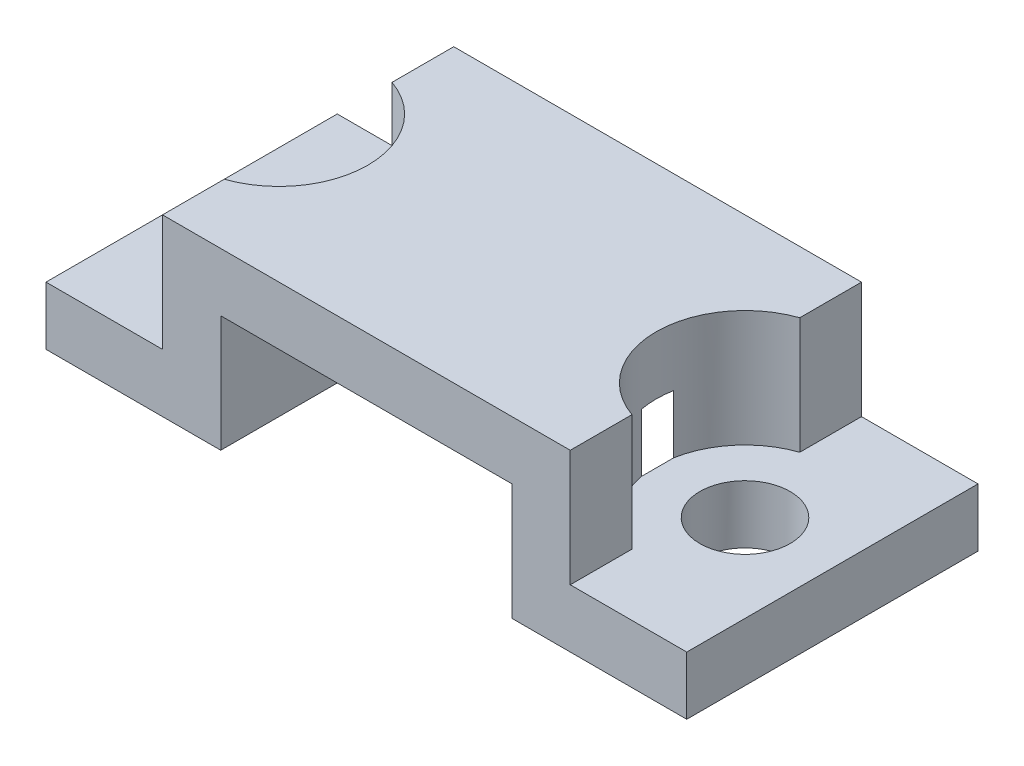
ISO-10303-21;
HEADER;
FILE_DESCRIPTION(('STEP AP214'),'2;1');
FILE_NAME('part.step','',(''),(''),'','','');
FILE_SCHEMA(('AUTOMOTIVE_DESIGN { 1 0 10303 214 1 1 1 1 }'));
ENDSEC;
DATA;
#1=APPLICATION_CONTEXT('core data for automotive mechanical design processes');
#2=APPLICATION_PROTOCOL_DEFINITION('international standard','automotive_design',2000,#1);
#3=PRODUCT_CONTEXT('',#1,'mechanical');
#4=PRODUCT('Part','Part','',(#3));
#5=PRODUCT_RELATED_PRODUCT_CATEGORY('part','',(#4));
#6=PRODUCT_DEFINITION_FORMATION('','',#4);
#7=PRODUCT_DEFINITION_CONTEXT('part definition',#1,'design');
#8=PRODUCT_DEFINITION('design','',#6,#7);
#9=PRODUCT_DEFINITION_SHAPE('','',#8);
#10=(LENGTH_UNIT() NAMED_UNIT(*) SI_UNIT(.MILLI.,.METRE.));
#11=(NAMED_UNIT(*) PLANE_ANGLE_UNIT() SI_UNIT($,.RADIAN.));
#12=(NAMED_UNIT(*) SI_UNIT($,.STERADIAN.) SOLID_ANGLE_UNIT());
#13=UNCERTAINTY_MEASURE_WITH_UNIT(LENGTH_MEASURE(1.E-05),#10,'distance_accuracy_value','');
#14=(GEOMETRIC_REPRESENTATION_CONTEXT(3) GLOBAL_UNCERTAINTY_ASSIGNED_CONTEXT((#13)) GLOBAL_UNIT_ASSIGNED_CONTEXT((#10,
#11,#12)) REPRESENTATION_CONTEXT('',''));
#15=CARTESIAN_POINT('',(0.,0.,0.));
#16=DIRECTION('',(0.,0.,1.));
#17=DIRECTION('',(1.,0.,0.));
#18=AXIS2_PLACEMENT_3D('',#15,#16,#17);
#19=CARTESIAN_POINT('',(-5.,0.,-19.));
#20=DIRECTION('',(1.,0.,0.));
#21=DIRECTION('',(0.,0.,-1.));
#22=AXIS2_PLACEMENT_3D('',#19,#20,#21);
#23=PLANE('',#22);
#24=DIRECTION('',(0.,0.,1.));
#25=VECTOR('',#24,1.);
#26=CARTESIAN_POINT('',(-5.,2.,-19.));
#27=LINE('',#26,#25);
#28=CARTESIAN_POINT('',(-5.,2.,-0.550000000000018));
#29=VERTEX_POINT('',#28);
#30=CARTESIAN_POINT('',(-5.,2.,0.550000000000018));
#31=VERTEX_POINT('',#30);
#32=EDGE_CURVE('E394',#29,#31,#27,.T.);
#33=ORIENTED_EDGE('',*,*,#32,.T.);
#34=DIRECTION('',(0.,-1.,0.));
#35=VECTOR('',#34,1.);
#36=CARTESIAN_POINT('',(-5.,7.99999999999999,0.550000000000018));
#37=LINE('',#36,#35);
#38=CARTESIAN_POINT('',(-5.,4.,0.550000000000018));
#39=VERTEX_POINT('',#38);
#40=EDGE_CURVE('E379',#31,#39,#37,.F.);
#41=ORIENTED_EDGE('',*,*,#40,.T.);
#42=DIRECTION('',(0.,0.,1.));
#43=VECTOR('',#42,1.);
#44=CARTESIAN_POINT('',(-5.,4.,-19.));
#45=LINE('',#44,#43);
#46=CARTESIAN_POINT('',(-5.,4.,5.));
#47=VERTEX_POINT('',#46);
#48=EDGE_CURVE('E227',#39,#47,#45,.T.);
#49=ORIENTED_EDGE('',*,*,#48,.T.);
#50=DIRECTION('',(0.,1.,0.));
#51=VECTOR('',#50,1.);
#52=CARTESIAN_POINT('',(-5.,0.,5.));
#53=LINE('',#52,#51);
#54=CARTESIAN_POINT('',(-5.,0.,5.));
#55=VERTEX_POINT('',#54);
#56=EDGE_CURVE('E217',#55,#47,#53,.T.);
#57=ORIENTED_EDGE('',*,*,#56,.F.);
#58=DIRECTION('',(0.,0.,1.));
#59=VECTOR('',#58,1.);
#60=CARTESIAN_POINT('',(-5.,0.,0.));
#61=LINE('',#60,#59);
#62=CARTESIAN_POINT('',(-5.,0.,-5.));
#63=VERTEX_POINT('',#62);
#64=EDGE_CURVE('E296',#63,#55,#61,.T.);
#65=ORIENTED_EDGE('',*,*,#64,.F.);
#66=DIRECTION('',(0.,1.,0.));
#67=VECTOR('',#66,1.);
#68=CARTESIAN_POINT('',(-5.,6.,-5.));
#69=LINE('',#68,#67);
#70=CARTESIAN_POINT('',(-5.,4.,-5.));
#71=VERTEX_POINT('',#70);
#72=EDGE_CURVE('E236',#63,#71,#69,.T.);
#73=ORIENTED_EDGE('',*,*,#72,.T.);
#74=CARTESIAN_POINT('',(-5.,4.,-0.550000000000018));
#75=VERTEX_POINT('',#74);
#76=EDGE_CURVE('E222',#71,#75,#45,.T.);
#77=ORIENTED_EDGE('',*,*,#76,.T.);
#78=DIRECTION('',(0.,-1.,0.));
#79=VECTOR('',#78,1.);
#80=CARTESIAN_POINT('',(-5.,7.99999999999999,-0.550000000000018));
#81=LINE('',#80,#79);
#82=EDGE_CURVE('E387',#75,#29,#81,.T.);
#83=ORIENTED_EDGE('',*,*,#82,.T.);
#84=EDGE_LOOP('',(#33,#41,#49,#57,#65,#73,#77,#83));
#85=FACE_BOUND('',#84,.T.);
#86=ADVANCED_FACE('F39',(#85),#23,.T.);
#87=CARTESIAN_POINT('',(5.,0.,-19.));
#88=DIRECTION('',(1.,0.,0.));
#89=DIRECTION('',(0.,0.,-1.));
#90=AXIS2_PLACEMENT_3D('',#87,#88,#89);
#91=PLANE('',#90);
#92=DIRECTION('',(0.,-1.,0.));
#93=VECTOR('',#92,1.);
#94=CARTESIAN_POINT('',(5.,7.99999999999999,0.550000000000008));
#95=LINE('',#94,#93);
#96=CARTESIAN_POINT('',(5.,2.,0.550000000000008));
#97=VERTEX_POINT('',#96);
#98=CARTESIAN_POINT('',(5.,4.,0.550000000000008));
#99=VERTEX_POINT('',#98);
#100=EDGE_CURVE('E365',#97,#99,#95,.F.);
#101=ORIENTED_EDGE('',*,*,#100,.F.);
#102=DIRECTION('',(0.,0.,1.));
#103=VECTOR('',#102,1.);
#104=CARTESIAN_POINT('',(5.,2.,-19.));
#105=LINE('',#104,#103);
#106=CARTESIAN_POINT('',(5.,2.,-0.550000000000009));
#107=VERTEX_POINT('',#106);
#108=EDGE_CURVE('E325',#107,#97,#105,.T.);
#109=ORIENTED_EDGE('',*,*,#108,.F.);
#110=DIRECTION('',(0.,-1.,0.));
#111=VECTOR('',#110,1.);
#112=CARTESIAN_POINT('',(5.,7.99999999999999,-0.550000000000009));
#113=LINE('',#112,#111);
#114=CARTESIAN_POINT('',(5.,4.,-0.550000000000009));
#115=VERTEX_POINT('',#114);
#116=EDGE_CURVE('E178',#115,#107,#113,.T.);
#117=ORIENTED_EDGE('',*,*,#116,.F.);
#118=DIRECTION('',(0.,0.,1.));
#119=VECTOR('',#118,1.);
#120=CARTESIAN_POINT('',(5.,4.,-19.));
#121=LINE('',#120,#119);
#122=CARTESIAN_POINT('',(5.,4.,-5.));
#123=VERTEX_POINT('',#122);
#124=EDGE_CURVE('E228',#123,#115,#121,.T.);
#125=ORIENTED_EDGE('',*,*,#124,.F.);
#126=DIRECTION('',(0.,1.,0.));
#127=VECTOR('',#126,1.);
#128=CARTESIAN_POINT('',(5.,6.,-5.));
#129=LINE('',#128,#127);
#130=CARTESIAN_POINT('',(5.,0.,-5.));
#131=VERTEX_POINT('',#130);
#132=EDGE_CURVE('E232',#131,#123,#129,.T.);
#133=ORIENTED_EDGE('',*,*,#132,.F.);
#134=DIRECTION('',(0.,0.,1.));
#135=VECTOR('',#134,1.);
#136=CARTESIAN_POINT('',(5.,0.,0.));
#137=LINE('',#136,#135);
#138=CARTESIAN_POINT('',(5.,0.,5.));
#139=VERTEX_POINT('',#138);
#140=EDGE_CURVE('E293',#131,#139,#137,.T.);
#141=ORIENTED_EDGE('',*,*,#140,.T.);
#142=DIRECTION('',(0.,1.,0.));
#143=VECTOR('',#142,1.);
#144=CARTESIAN_POINT('',(5.,0.,5.));
#145=LINE('',#144,#143);
#146=CARTESIAN_POINT('',(5.,4.,5.));
#147=VERTEX_POINT('',#146);
#148=EDGE_CURVE('E208',#139,#147,#145,.T.);
#149=ORIENTED_EDGE('',*,*,#148,.T.);
#150=EDGE_CURVE('E221',#99,#147,#121,.T.);
#151=ORIENTED_EDGE('',*,*,#150,.F.);
#152=EDGE_LOOP('',(#101,#109,#117,#125,#133,#141,#149,#151));
#153=FACE_BOUND('',#152,.T.);
#154=ADVANCED_FACE('F432',(#153),#91,.F.);
#155=CARTESIAN_POINT('',(7.,0.,-19.));
#156=DIRECTION('',(-1.,0.,0.));
#157=DIRECTION('',(0.,-1.,0.));
#158=AXIS2_PLACEMENT_3D('',#155,#156,#157);
#159=PLANE('',#158);
#160=DIRECTION('',(0.,-1.,0.));
#161=VECTOR('',#160,1.);
#162=CARTESIAN_POINT('',(7.,7.99999999999999,-2.88140590684478));
#163=LINE('',#162,#161);
#164=CARTESIAN_POINT('',(7.,2.,-2.88140590684478));
#165=VERTEX_POINT('',#164);
#166=CARTESIAN_POINT('',(7.,6.,-2.88140590684478));
#167=VERTEX_POINT('',#166);
#168=EDGE_CURVE('E11',#165,#167,#163,.F.);
#169=ORIENTED_EDGE('',*,*,#168,.F.);
#170=DIRECTION('',(0.,0.,1.));
#171=VECTOR('',#170,1.);
#172=CARTESIAN_POINT('',(7.,2.,-19.));
#173=LINE('',#172,#171);
#174=CARTESIAN_POINT('',(7.,2.,-5.));
#175=VERTEX_POINT('',#174);
#176=EDGE_CURVE('E189',#175,#165,#173,.T.);
#177=ORIENTED_EDGE('',*,*,#176,.F.);
#178=DIRECTION('',(0.,-1.,0.));
#179=VECTOR('',#178,1.);
#180=CARTESIAN_POINT('',(7.,6.,-5.));
#181=LINE('',#180,#179);
#182=CARTESIAN_POINT('',(7.,6.,-5.));
#183=VERTEX_POINT('',#182);
#184=EDGE_CURVE('E240',#183,#175,#181,.T.);
#185=ORIENTED_EDGE('',*,*,#184,.F.);
#186=DIRECTION('',(0.,0.,-1.));
#187=VECTOR('',#186,1.);
#188=CARTESIAN_POINT('',(7.,6.,0.));
#189=LINE('',#188,#187);
#190=EDGE_CURVE('E191',#167,#183,#189,.T.);
#191=ORIENTED_EDGE('',*,*,#190,.F.);
#192=EDGE_LOOP('',(#169,#177,#185,#191));
#193=FACE_BOUND('',#192,.T.);
#194=ADVANCED_FACE('F187',(#193),#159,.F.);
#195=DIRECTION('',(0.,-1.,0.));
#196=VECTOR('',#195,1.);
#197=CARTESIAN_POINT('',(7.,7.99999999999999,2.88140590684478));
#198=LINE('',#197,#196);
#199=CARTESIAN_POINT('',(7.,6.,2.88140590684478));
#200=VERTEX_POINT('',#199);
#201=CARTESIAN_POINT('',(7.,2.,2.88140590684478));
#202=VERTEX_POINT('',#201);
#203=EDGE_CURVE('E48',#200,#202,#198,.T.);
#204=ORIENTED_EDGE('',*,*,#203,.F.);
#205=CARTESIAN_POINT('',(7.,6.,5.));
#206=VERTEX_POINT('',#205);
#207=EDGE_CURVE('E300',#206,#200,#189,.T.);
#208=ORIENTED_EDGE('',*,*,#207,.F.);
#209=DIRECTION('',(0.,-1.,0.));
#210=VECTOR('',#209,1.);
#211=CARTESIAN_POINT('',(7.,0.,5.));
#212=LINE('',#211,#210);
#213=CARTESIAN_POINT('',(7.,2.,5.));
#214=VERTEX_POINT('',#213);
#215=EDGE_CURVE('E226',#206,#214,#212,.T.);
#216=ORIENTED_EDGE('',*,*,#215,.T.);
#217=EDGE_CURVE('E199',#202,#214,#173,.T.);
#218=ORIENTED_EDGE('',*,*,#217,.F.);
#219=EDGE_LOOP('',(#204,#208,#216,#218));
#220=FACE_BOUND('',#219,.T.);
#221=ADVANCED_FACE('F327',(#220),#159,.F.);
#222=CARTESIAN_POINT('',(-7.,0.,-19.));
#223=DIRECTION('',(-1.,0.,0.));
#224=DIRECTION('',(0.,-1.,0.));
#225=AXIS2_PLACEMENT_3D('',#222,#223,#224);
#226=PLANE('',#225);
#227=DIRECTION('',(0.,0.,1.));
#228=VECTOR('',#227,1.);
#229=CARTESIAN_POINT('',(-7.,2.,-19.));
#230=LINE('',#229,#228);
#231=CARTESIAN_POINT('',(-7.,2.,-5.));
#232=VERTEX_POINT('',#231);
#233=CARTESIAN_POINT('',(-7.,2.,-2.88140590684478));
#234=VERTEX_POINT('',#233);
#235=EDGE_CURVE('E237',#232,#234,#230,.T.);
#236=ORIENTED_EDGE('',*,*,#235,.T.);
#237=DIRECTION('',(0.,-1.,0.));
#238=VECTOR('',#237,1.);
#239=CARTESIAN_POINT('',(-7.,7.99999999999999,-2.88140590684478));
#240=LINE('',#239,#238);
#241=CARTESIAN_POINT('',(-7.,6.,-2.88140590684478));
#242=VERTEX_POINT('',#241);
#243=EDGE_CURVE('E313',#234,#242,#240,.F.);
#244=ORIENTED_EDGE('',*,*,#243,.T.);
#245=DIRECTION('',(0.,0.,-1.));
#246=VECTOR('',#245,1.);
#247=CARTESIAN_POINT('',(-7.,6.,0.));
#248=LINE('',#247,#246);
#249=CARTESIAN_POINT('',(-7.,6.,-5.));
#250=VERTEX_POINT('',#249);
#251=EDGE_CURVE('E304',#242,#250,#248,.T.);
#252=ORIENTED_EDGE('',*,*,#251,.T.);
#253=DIRECTION('',(0.,-1.,0.));
#254=VECTOR('',#253,1.);
#255=CARTESIAN_POINT('',(-7.,6.,-5.));
#256=LINE('',#255,#254);
#257=EDGE_CURVE('E243',#250,#232,#256,.T.);
#258=ORIENTED_EDGE('',*,*,#257,.T.);
#259=EDGE_LOOP('',(#236,#244,#252,#258));
#260=FACE_BOUND('',#259,.T.);
#261=ADVANCED_FACE('F409',(#260),#226,.T.);
#262=CARTESIAN_POINT('',(-7.,6.,5.));
#263=VERTEX_POINT('',#262);
#264=CARTESIAN_POINT('',(-7.,6.,2.88140590684478));
#265=VERTEX_POINT('',#264);
#266=EDGE_CURVE('E305',#263,#265,#248,.T.);
#267=ORIENTED_EDGE('',*,*,#266,.T.);
#268=DIRECTION('',(0.,-1.,0.));
#269=VECTOR('',#268,1.);
#270=CARTESIAN_POINT('',(-7.,7.99999999999999,2.88140590684478));
#271=LINE('',#270,#269);
#272=CARTESIAN_POINT('',(-7.,2.,2.88140590684478));
#273=VERTEX_POINT('',#272);
#274=EDGE_CURVE('E309',#265,#273,#271,.T.);
#275=ORIENTED_EDGE('',*,*,#274,.T.);
#276=CARTESIAN_POINT('',(-7.,2.,5.));
#277=VERTEX_POINT('',#276);
#278=EDGE_CURVE('E343',#273,#277,#230,.T.);
#279=ORIENTED_EDGE('',*,*,#278,.T.);
#280=DIRECTION('',(0.,-1.,0.));
#281=VECTOR('',#280,1.);
#282=CARTESIAN_POINT('',(-7.,0.,5.));
#283=LINE('',#282,#281);
#284=EDGE_CURVE('E203',#263,#277,#283,.T.);
#285=ORIENTED_EDGE('',*,*,#284,.F.);
#286=EDGE_LOOP('',(#267,#275,#279,#285));
#287=FACE_BOUND('',#286,.T.);
#288=ADVANCED_FACE('F449',(#287),#226,.T.);
#289=CARTESIAN_POINT('',(11.,6.,5.));
#290=DIRECTION('',(-1.,0.,0.));
#291=DIRECTION('',(0.,0.,1.));
#292=AXIS2_PLACEMENT_3D('',#289,#290,#291);
#293=PLANE('',#292);
#294=DIRECTION('',(0.,0.,1.));
#295=VECTOR('',#294,1.);
#296=CARTESIAN_POINT('',(11.,2.00000000000001,-19.));
#297=LINE('',#296,#295);
#298=CARTESIAN_POINT('',(11.,2.00000000000001,-5.));
#299=VERTEX_POINT('',#298);
#300=CARTESIAN_POINT('',(11.,2.00000000000001,5.));
#301=VERTEX_POINT('',#300);
#302=EDGE_CURVE('E198',#299,#301,#297,.T.);
#303=ORIENTED_EDGE('',*,*,#302,.T.);
#304=DIRECTION('',(0.,-1.,0.));
#305=VECTOR('',#304,1.);
#306=CARTESIAN_POINT('',(11.,6.,5.));
#307=LINE('',#306,#305);
#308=CARTESIAN_POINT('',(11.,0.,5.));
#309=VERTEX_POINT('',#308);
#310=EDGE_CURVE('E265',#301,#309,#307,.T.);
#311=ORIENTED_EDGE('',*,*,#310,.T.);
#312=DIRECTION('',(0.,0.,-1.));
#313=VECTOR('',#312,1.);
#314=CARTESIAN_POINT('',(11.,0.,5.));
#315=LINE('',#314,#313);
#316=CARTESIAN_POINT('',(11.,0.,-5.));
#317=VERTEX_POINT('',#316);
#318=EDGE_CURVE('E255',#309,#317,#315,.T.);
#319=ORIENTED_EDGE('',*,*,#318,.T.);
#320=DIRECTION('',(0.,-1.,0.));
#321=VECTOR('',#320,1.);
#322=CARTESIAN_POINT('',(11.,6.,-5.));
#323=LINE('',#322,#321);
#324=EDGE_CURVE('E290',#299,#317,#323,.T.);
#325=ORIENTED_EDGE('',*,*,#324,.F.);
#326=EDGE_LOOP('',(#303,#311,#319,#325));
#327=FACE_BOUND('',#326,.T.);
#328=ADVANCED_FACE('F41',(#327),#293,.F.);
#329=CARTESIAN_POINT('',(-11.,6.,-5.));
#330=DIRECTION('',(0.,0.,1.));
#331=DIRECTION('',(1.,0.,0.));
#332=AXIS2_PLACEMENT_3D('',#329,#330,#331);
#333=PLANE('',#332);
#334=ORIENTED_EDGE('',*,*,#257,.F.);
#335=DIRECTION('',(-1.,0.,0.));
#336=VECTOR('',#335,1.);
#337=CARTESIAN_POINT('',(-11.,6.,-5.));
#338=LINE('',#337,#336);
#339=EDGE_CURVE('E256',#183,#250,#338,.T.);
#340=ORIENTED_EDGE('',*,*,#339,.F.);
#341=ORIENTED_EDGE('',*,*,#184,.T.);
#342=DIRECTION('',(-1.,0.,0.));
#343=VECTOR('',#342,1.);
#344=CARTESIAN_POINT('',(-11.,2.,-5.));
#345=LINE('',#344,#343);
#346=EDGE_CURVE('E196',#299,#175,#345,.T.);
#347=ORIENTED_EDGE('',*,*,#346,.F.);
#348=ORIENTED_EDGE('',*,*,#324,.T.);
#349=DIRECTION('',(-1.,0.,0.));
#350=VECTOR('',#349,1.);
#351=CARTESIAN_POINT('',(-11.,0.,-5.));
#352=LINE('',#351,#350);
#353=EDGE_CURVE('E270',#317,#131,#352,.T.);
#354=ORIENTED_EDGE('',*,*,#353,.T.);
#355=ORIENTED_EDGE('',*,*,#132,.T.);
#356=DIRECTION('',(1.,0.,0.));
#357=VECTOR('',#356,1.);
#358=CARTESIAN_POINT('',(-11.,4.,-5.));
#359=LINE('',#358,#357);
#360=EDGE_CURVE('E246',#71,#123,#359,.T.);
#361=ORIENTED_EDGE('',*,*,#360,.F.);
#362=ORIENTED_EDGE('',*,*,#72,.F.);
#363=CARTESIAN_POINT('',(-11.,0.,-5.));
#364=VERTEX_POINT('',#363);
#365=EDGE_CURVE('E269',#63,#364,#352,.T.);
#366=ORIENTED_EDGE('',*,*,#365,.T.);
#367=DIRECTION('',(0.,-1.,0.));
#368=VECTOR('',#367,1.);
#369=CARTESIAN_POINT('',(-11.,6.,-5.));
#370=LINE('',#369,#368);
#371=CARTESIAN_POINT('',(-11.,2.,-5.));
#372=VERTEX_POINT('',#371);
#373=EDGE_CURVE('E287',#372,#364,#370,.T.);
#374=ORIENTED_EDGE('',*,*,#373,.F.);
#375=DIRECTION('',(1.,0.,0.));
#376=VECTOR('',#375,1.);
#377=CARTESIAN_POINT('',(-11.,2.,-5.));
#378=LINE('',#377,#376);
#379=EDGE_CURVE('E251',#372,#232,#378,.T.);
#380=ORIENTED_EDGE('',*,*,#379,.T.);
#381=EDGE_LOOP('',(#334,#340,#341,#347,#348,#354,#355,#361,#362,#366,#374,#380));
#382=FACE_BOUND('',#381,.T.);
#383=ADVANCED_FACE('F414',(#382),#333,.F.);
#384=CARTESIAN_POINT('',(-11.,6.,5.));
#385=DIRECTION('',(0.,0.,-1.));
#386=DIRECTION('',(-1.,0.,0.));
#387=AXIS2_PLACEMENT_3D('',#384,#385,#386);
#388=PLANE('',#387);
#389=ORIENTED_EDGE('',*,*,#284,.T.);
#390=DIRECTION('',(1.,0.,0.));
#391=VECTOR('',#390,1.);
#392=CARTESIAN_POINT('',(0.,2.,5.));
#393=LINE('',#392,#391);
#394=CARTESIAN_POINT('',(-11.,2.,5.));
#395=VERTEX_POINT('',#394);
#396=EDGE_CURVE('E344',#395,#277,#393,.T.);
#397=ORIENTED_EDGE('',*,*,#396,.F.);
#398=DIRECTION('',(0.,-1.,0.));
#399=VECTOR('',#398,1.);
#400=CARTESIAN_POINT('',(-11.,6.,5.));
#401=LINE('',#400,#399);
#402=CARTESIAN_POINT('',(-11.,0.,5.));
#403=VERTEX_POINT('',#402);
#404=EDGE_CURVE('E284',#395,#403,#401,.T.);
#405=ORIENTED_EDGE('',*,*,#404,.T.);
#406=DIRECTION('',(1.,0.,0.));
#407=VECTOR('',#406,1.);
#408=CARTESIAN_POINT('',(-11.,0.,5.));
#409=LINE('',#408,#407);
#410=EDGE_CURVE('E261',#403,#55,#409,.T.);
#411=ORIENTED_EDGE('',*,*,#410,.T.);
#412=ORIENTED_EDGE('',*,*,#56,.T.);
#413=DIRECTION('',(1.,0.,0.));
#414=VECTOR('',#413,1.);
#415=CARTESIAN_POINT('',(0.,4.,5.));
#416=LINE('',#415,#414);
#417=EDGE_CURVE('E212',#47,#147,#416,.T.);
#418=ORIENTED_EDGE('',*,*,#417,.T.);
#419=ORIENTED_EDGE('',*,*,#148,.F.);
#420=EDGE_CURVE('E278',#139,#309,#409,.T.);
#421=ORIENTED_EDGE('',*,*,#420,.T.);
#422=ORIENTED_EDGE('',*,*,#310,.F.);
#423=DIRECTION('',(-1.,0.,0.));
#424=VECTOR('',#423,1.);
#425=CARTESIAN_POINT('',(0.,2.,5.));
#426=LINE('',#425,#424);
#427=EDGE_CURVE('E205',#301,#214,#426,.T.);
#428=ORIENTED_EDGE('',*,*,#427,.T.);
#429=ORIENTED_EDGE('',*,*,#215,.F.);
#430=DIRECTION('',(1.,0.,0.));
#431=VECTOR('',#430,1.);
#432=CARTESIAN_POINT('',(-11.,6.,5.));
#433=LINE('',#432,#431);
#434=EDGE_CURVE('E260',#263,#206,#433,.T.);
#435=ORIENTED_EDGE('',*,*,#434,.F.);
#436=EDGE_LOOP('',(#389,#397,#405,#411,#412,#418,#419,#421,#422,#428,#429,#435));
#437=FACE_BOUND('',#436,.T.);
#438=ADVANCED_FACE('F336',(#437),#388,.F.);
#439=CARTESIAN_POINT('',(0.,6.,0.));
#440=DIRECTION('',(0.,-1.,0.));
#441=DIRECTION('',(0.,0.,-1.));
#442=AXIS2_PLACEMENT_3D('',#439,#440,#441);
#443=PLANE('',#442);
#444=CARTESIAN_POINT('',(-8.,6.,0.));
#445=DIRECTION('',(0.,-1.,0.));
#446=DIRECTION('',(0.,0.,-1.));
#447=AXIS2_PLACEMENT_3D('',#444,#445,#446);
#448=CIRCLE('',#447,3.05);
#449=EDGE_CURVE('E391',#265,#242,#448,.F.);
#450=ORIENTED_EDGE('',*,*,#449,.F.);
#451=ORIENTED_EDGE('',*,*,#266,.F.);
#452=ORIENTED_EDGE('',*,*,#434,.T.);
#453=ORIENTED_EDGE('',*,*,#207,.T.);
#454=CARTESIAN_POINT('',(8.,6.,0.));
#455=DIRECTION('',(0.,-1.,0.));
#456=DIRECTION('',(0.,0.,-1.));
#457=AXIS2_PLACEMENT_3D('',#454,#455,#456);
#458=CIRCLE('',#457,3.05);
#459=EDGE_CURVE('E321',#167,#200,#458,.F.);
#460=ORIENTED_EDGE('',*,*,#459,.F.);
#461=ORIENTED_EDGE('',*,*,#190,.T.);
#462=ORIENTED_EDGE('',*,*,#339,.T.);
#463=ORIENTED_EDGE('',*,*,#251,.F.);
#464=EDGE_LOOP('',(#450,#451,#452,#453,#460,#461,#462,#463));
#465=FACE_BOUND('',#464,.T.);
#466=ADVANCED_FACE('F418',(#465),#443,.F.);
#467=CARTESIAN_POINT('',(0.,0.,0.));
#468=DIRECTION('',(0.,-1.,0.));
#469=DIRECTION('',(0.,0.,-1.));
#470=AXIS2_PLACEMENT_3D('',#467,#468,#469);
#471=PLANE('',#470);
#472=CARTESIAN_POINT('',(-8.,0.,0.));
#473=DIRECTION('',(0.,-1.,0.));
#474=DIRECTION('',(0.,0.,-1.));
#475=AXIS2_PLACEMENT_3D('',#472,#473,#474);
#476=CIRCLE('',#475,1.55);
#477=CARTESIAN_POINT('',(-8.,0.,-1.55));
#478=VERTEX_POINT('',#477);
#479=EDGE_CURVE('E356',#478,#478,#476,.T.);
#480=ORIENTED_EDGE('',*,*,#479,.F.);
#481=EDGE_LOOP('',(#480));
#482=FACE_BOUND('',#481,.T.);
#483=ORIENTED_EDGE('',*,*,#365,.F.);
#484=ORIENTED_EDGE('',*,*,#64,.T.);
#485=ORIENTED_EDGE('',*,*,#410,.F.);
#486=DIRECTION('',(0.,0.,1.));
#487=VECTOR('',#486,1.);
#488=CARTESIAN_POINT('',(-11.,0.,5.));
#489=LINE('',#488,#487);
#490=EDGE_CURVE('E274',#364,#403,#489,.T.);
#491=ORIENTED_EDGE('',*,*,#490,.F.);
#492=EDGE_LOOP('',(#483,#484,#485,#491));
#493=FACE_BOUND('',#492,.T.);
#494=ADVANCED_FACE('F444',(#482,#493),#471,.T.);
#495=CARTESIAN_POINT('',(-11.,6.,5.));
#496=DIRECTION('',(1.,0.,0.));
#497=DIRECTION('',(0.,0.,-1.));
#498=AXIS2_PLACEMENT_3D('',#495,#496,#497);
#499=PLANE('',#498);
#500=ORIENTED_EDGE('',*,*,#404,.F.);
#501=DIRECTION('',(0.,0.,1.));
#502=VECTOR('',#501,1.);
#503=CARTESIAN_POINT('',(-11.,2.,-19.));
#504=LINE('',#503,#502);
#505=EDGE_CURVE('E340',#372,#395,#504,.T.);
#506=ORIENTED_EDGE('',*,*,#505,.F.);
#507=ORIENTED_EDGE('',*,*,#373,.T.);
#508=ORIENTED_EDGE('',*,*,#490,.T.);
#509=EDGE_LOOP('',(#500,#506,#507,#508));
#510=FACE_BOUND('',#509,.T.);
#511=ADVANCED_FACE('F459',(#510),#499,.F.);
#512=CARTESIAN_POINT('',(8.,0.,0.));
#513=DIRECTION('',(0.,-1.,0.));
#514=DIRECTION('',(0.,0.,-1.));
#515=AXIS2_PLACEMENT_3D('',#512,#513,#514);
#516=CIRCLE('',#515,1.55);
#517=CARTESIAN_POINT('',(8.,0.,-1.55));
#518=VERTEX_POINT('',#517);
#519=EDGE_CURVE('E213',#518,#518,#516,.T.);
#520=ORIENTED_EDGE('',*,*,#519,.F.);
#521=EDGE_LOOP('',(#520));
#522=FACE_BOUND('',#521,.T.);
#523=ORIENTED_EDGE('',*,*,#140,.F.);
#524=ORIENTED_EDGE('',*,*,#353,.F.);
#525=ORIENTED_EDGE('',*,*,#318,.F.);
#526=ORIENTED_EDGE('',*,*,#420,.F.);
#527=EDGE_LOOP('',(#523,#524,#525,#526));
#528=FACE_BOUND('',#527,.T.);
#529=ADVANCED_FACE('F427',(#522,#528),#471,.T.);
#530=CARTESIAN_POINT('',(0.,4.,-19.));
#531=DIRECTION('',(0.,-1.,0.));
#532=DIRECTION('',(0.,0.,-1.));
#533=AXIS2_PLACEMENT_3D('',#530,#531,#532);
#534=PLANE('',#533);
#535=ORIENTED_EDGE('',*,*,#48,.F.);
#536=CARTESIAN_POINT('',(-8.,4.,0.));
#537=DIRECTION('',(0.,-1.,0.));
#538=DIRECTION('',(0.,0.,-1.));
#539=AXIS2_PLACEMENT_3D('',#536,#537,#538);
#540=CIRCLE('',#539,3.05);
#541=EDGE_CURVE('E383',#39,#75,#540,.F.);
#542=ORIENTED_EDGE('',*,*,#541,.T.);
#543=ORIENTED_EDGE('',*,*,#76,.F.);
#544=ORIENTED_EDGE('',*,*,#360,.T.);
#545=ORIENTED_EDGE('',*,*,#124,.T.);
#546=CARTESIAN_POINT('',(8.,4.,0.));
#547=DIRECTION('',(0.,-1.,0.));
#548=DIRECTION('',(0.,0.,-1.));
#549=AXIS2_PLACEMENT_3D('',#546,#547,#548);
#550=CIRCLE('',#549,3.05);
#551=EDGE_CURVE('E371',#115,#99,#550,.F.);
#552=ORIENTED_EDGE('',*,*,#551,.T.);
#553=ORIENTED_EDGE('',*,*,#150,.T.);
#554=ORIENTED_EDGE('',*,*,#417,.F.);
#555=EDGE_LOOP('',(#535,#542,#543,#544,#545,#552,#553,#554));
#556=FACE_BOUND('',#555,.T.);
#557=ADVANCED_FACE('F436',(#556),#534,.T.);
#558=CARTESIAN_POINT('',(0.,2.,-19.));
#559=DIRECTION('',(0.,1.,0.));
#560=DIRECTION('',(-1.,0.,0.));
#561=AXIS2_PLACEMENT_3D('',#558,#559,#560);
#562=PLANE('',#561);
#563=ORIENTED_EDGE('',*,*,#427,.F.);
#564=ORIENTED_EDGE('',*,*,#302,.F.);
#565=ORIENTED_EDGE('',*,*,#346,.T.);
#566=ORIENTED_EDGE('',*,*,#176,.T.);
#567=CARTESIAN_POINT('',(8.,2.,0.));
#568=DIRECTION('',(0.,1.,0.));
#569=DIRECTION('',(0.,0.,1.));
#570=AXIS2_PLACEMENT_3D('',#567,#568,#569);
#571=CIRCLE('',#570,3.05);
#572=EDGE_CURVE('E63',#165,#107,#571,.T.);
#573=ORIENTED_EDGE('',*,*,#572,.T.);
#574=ORIENTED_EDGE('',*,*,#108,.T.);
#575=EDGE_CURVE('E182',#97,#202,#571,.T.);
#576=ORIENTED_EDGE('',*,*,#575,.T.);
#577=ORIENTED_EDGE('',*,*,#217,.T.);
#578=EDGE_LOOP('',(#563,#564,#565,#566,#573,#574,#576,#577));
#579=FACE_BOUND('',#578,.T.);
#580=CARTESIAN_POINT('',(8.,2.,0.));
#581=DIRECTION('',(0.,1.,0.));
#582=DIRECTION('',(0.,0.,1.));
#583=AXIS2_PLACEMENT_3D('',#580,#581,#582);
#584=CIRCLE('',#583,1.55);
#585=CARTESIAN_POINT('',(8.,2.,1.55));
#586=VERTEX_POINT('',#585);
#587=EDGE_CURVE('E360',#586,#586,#584,.T.);
#588=ORIENTED_EDGE('',*,*,#587,.F.);
#589=EDGE_LOOP('',(#588));
#590=FACE_BOUND('',#589,.T.);
#591=ADVANCED_FACE('F193',(#579,#590),#562,.T.);
#592=CARTESIAN_POINT('',(0.,2.,-19.));
#593=DIRECTION('',(0.,-1.,0.));
#594=DIRECTION('',(0.,0.,-1.));
#595=AXIS2_PLACEMENT_3D('',#592,#593,#594);
#596=PLANE('',#595);
#597=ORIENTED_EDGE('',*,*,#505,.T.);
#598=ORIENTED_EDGE('',*,*,#396,.T.);
#599=ORIENTED_EDGE('',*,*,#278,.F.);
#600=CARTESIAN_POINT('',(-8.,2.,0.));
#601=DIRECTION('',(0.,1.,0.));
#602=DIRECTION('',(0.,0.,1.));
#603=AXIS2_PLACEMENT_3D('',#600,#601,#602);
#604=CIRCLE('',#603,3.05);
#605=EDGE_CURVE('E55',#273,#31,#604,.T.);
#606=ORIENTED_EDGE('',*,*,#605,.T.);
#607=ORIENTED_EDGE('',*,*,#32,.F.);
#608=EDGE_CURVE('E181',#29,#234,#604,.T.);
#609=ORIENTED_EDGE('',*,*,#608,.T.);
#610=ORIENTED_EDGE('',*,*,#235,.F.);
#611=ORIENTED_EDGE('',*,*,#379,.F.);
#612=EDGE_LOOP('',(#597,#598,#599,#606,#607,#609,#610,#611));
#613=FACE_BOUND('',#612,.T.);
#614=CARTESIAN_POINT('',(-8.,2.,0.));
#615=DIRECTION('',(0.,1.,0.));
#616=DIRECTION('',(0.,0.,1.));
#617=AXIS2_PLACEMENT_3D('',#614,#615,#616);
#618=CIRCLE('',#617,1.55);
#619=CARTESIAN_POINT('',(-8.,2.,1.55));
#620=VERTEX_POINT('',#619);
#621=EDGE_CURVE('E361',#620,#620,#618,.T.);
#622=ORIENTED_EDGE('',*,*,#621,.F.);
#623=EDGE_LOOP('',(#622));
#624=FACE_BOUND('',#623,.T.);
#625=ADVANCED_FACE('F405',(#613,#624),#596,.F.);
#626=CARTESIAN_POINT('',(-8.,-3.99999999999999,0.));
#627=DIRECTION('',(0.,1.,0.));
#628=DIRECTION('',(0.,0.,1.));
#629=AXIS2_PLACEMENT_3D('',#626,#627,#628);
#630=CYLINDRICAL_SURFACE('',#629,1.55);
#631=ORIENTED_EDGE('',*,*,#479,.T.);
#632=EDGE_LOOP('',(#631));
#633=FACE_BOUND('',#632,.T.);
#634=ORIENTED_EDGE('',*,*,#621,.T.);
#635=EDGE_LOOP('',(#634));
#636=FACE_BOUND('',#635,.T.);
#637=ADVANCED_FACE('F502',(#633,#636),#630,.F.);
#638=CARTESIAN_POINT('',(8.,-3.99999999999999,0.));
#639=DIRECTION('',(0.,1.,0.));
#640=DIRECTION('',(0.,0.,1.));
#641=AXIS2_PLACEMENT_3D('',#638,#639,#640);
#642=CYLINDRICAL_SURFACE('',#641,1.55);
#643=ORIENTED_EDGE('',*,*,#519,.T.);
#644=EDGE_LOOP('',(#643));
#645=FACE_BOUND('',#644,.T.);
#646=ORIENTED_EDGE('',*,*,#587,.T.);
#647=EDGE_LOOP('',(#646));
#648=FACE_BOUND('',#647,.T.);
#649=ADVANCED_FACE('F506',(#645,#648),#642,.F.);
#650=CARTESIAN_POINT('',(8.,7.99999999999999,0.));
#651=DIRECTION('',(0.,-1.,0.));
#652=DIRECTION('',(0.,0.,-1.));
#653=AXIS2_PLACEMENT_3D('',#650,#651,#652);
#654=CYLINDRICAL_SURFACE('',#653,3.05);
#655=ORIENTED_EDGE('',*,*,#100,.T.);
#656=ORIENTED_EDGE('',*,*,#551,.F.);
#657=ORIENTED_EDGE('',*,*,#116,.T.);
#658=ORIENTED_EDGE('',*,*,#572,.F.);
#659=ORIENTED_EDGE('',*,*,#168,.T.);
#660=ORIENTED_EDGE('',*,*,#459,.T.);
#661=ORIENTED_EDGE('',*,*,#203,.T.);
#662=ORIENTED_EDGE('',*,*,#575,.F.);
#663=EDGE_LOOP('',(#655,#656,#657,#658,#659,#660,#661,#662));
#664=FACE_BOUND('',#663,.T.);
#665=ADVANCED_FACE('F175',(#664),#654,.F.);
#666=CARTESIAN_POINT('',(-8.,7.99999999999999,0.));
#667=DIRECTION('',(0.,-1.,0.));
#668=DIRECTION('',(0.,0.,-1.));
#669=AXIS2_PLACEMENT_3D('',#666,#667,#668);
#670=CYLINDRICAL_SURFACE('',#669,3.05);
#671=ORIENTED_EDGE('',*,*,#605,.F.);
#672=ORIENTED_EDGE('',*,*,#274,.F.);
#673=ORIENTED_EDGE('',*,*,#449,.T.);
#674=ORIENTED_EDGE('',*,*,#243,.F.);
#675=ORIENTED_EDGE('',*,*,#608,.F.);
#676=ORIENTED_EDGE('',*,*,#82,.F.);
#677=ORIENTED_EDGE('',*,*,#541,.F.);
#678=ORIENTED_EDGE('',*,*,#40,.F.);
#679=EDGE_LOOP('',(#671,#672,#673,#674,#675,#676,#677,#678));
#680=FACE_BOUND('',#679,.T.);
#681=ADVANCED_FACE('F454',(#680),#670,.F.);
#682=CLOSED_SHELL('',(#86,#154,#194,#221,#261,#288,#328,#383,#438,#466,#494,#511,#529,#557,#591,
#625,#637,#649,#665,#681));
#683=MANIFOLD_SOLID_BREP('B2',#682);
#684=ADVANCED_BREP_SHAPE_REPRESENTATION('',(#18,#683),#14);
#685=SHAPE_DEFINITION_REPRESENTATION(#9,#684);
ENDSEC;
END-ISO-10303-21;
